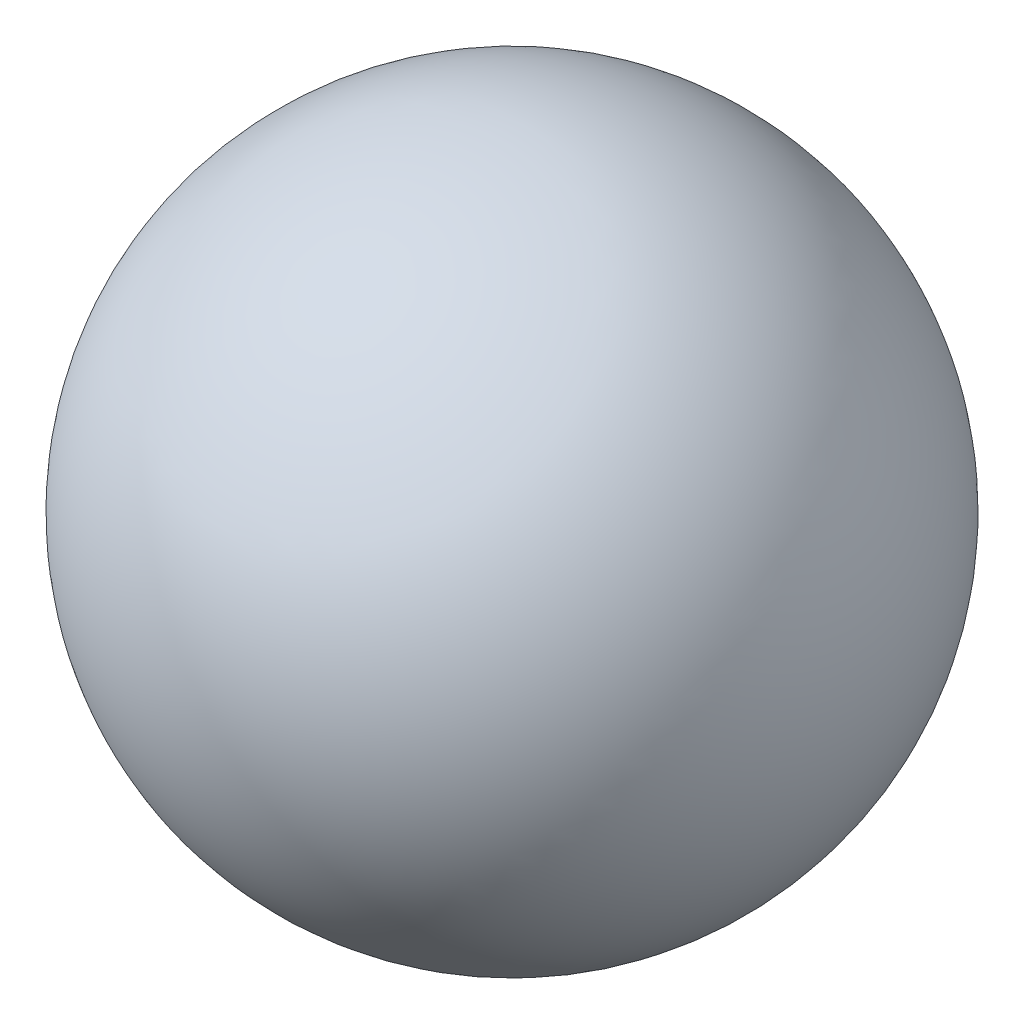
ISO-10303-21;
HEADER;
FILE_DESCRIPTION(('STEP AP214'),'2;1');
FILE_NAME('part.step','',(''),(''),'','','');
FILE_SCHEMA(('AUTOMOTIVE_DESIGN { 1 0 10303 214 1 1 1 1 }'));
ENDSEC;
DATA;
#1=APPLICATION_CONTEXT('core data for automotive mechanical design processes');
#2=APPLICATION_PROTOCOL_DEFINITION('international standard','automotive_design',2000,#1);
#3=PRODUCT_CONTEXT('',#1,'mechanical');
#4=PRODUCT('Part','Part','',(#3));
#5=PRODUCT_RELATED_PRODUCT_CATEGORY('part','',(#4));
#6=PRODUCT_DEFINITION_FORMATION('','',#4);
#7=PRODUCT_DEFINITION_CONTEXT('part definition',#1,'design');
#8=PRODUCT_DEFINITION('design','',#6,#7);
#9=PRODUCT_DEFINITION_SHAPE('','',#8);
#10=(LENGTH_UNIT() NAMED_UNIT(*) SI_UNIT(.MILLI.,.METRE.));
#11=(NAMED_UNIT(*) PLANE_ANGLE_UNIT() SI_UNIT($,.RADIAN.));
#12=(NAMED_UNIT(*) SI_UNIT($,.STERADIAN.) SOLID_ANGLE_UNIT());
#13=UNCERTAINTY_MEASURE_WITH_UNIT(LENGTH_MEASURE(1.E-05),#10,'distance_accuracy_value','');
#14=(GEOMETRIC_REPRESENTATION_CONTEXT(3) GLOBAL_UNCERTAINTY_ASSIGNED_CONTEXT((#13)) GLOBAL_UNIT_ASSIGNED_CONTEXT((#10,
#11,#12)) REPRESENTATION_CONTEXT('',''));
#15=CARTESIAN_POINT('',(0.,0.,0.));
#16=DIRECTION('',(0.,0.,1.));
#17=DIRECTION('',(1.,0.,0.));
#18=AXIS2_PLACEMENT_3D('',#15,#16,#17);
#19=CARTESIAN_POINT('',(-1.11690850882414,-2.,-11.6967950902337));
#20=DIRECTION('',(0.,0.,1.));
#21=DIRECTION('',(1.,0.,0.));
#22=AXIS2_PLACEMENT_3D('',#19,#20,#21);
#23=SPHERICAL_SURFACE('',#22,1.05);
#24=CARTESIAN_POINT('',(-1.11690850882414,-2.,-10.6467950902337));
#25=VERTEX_POINT('',#24);
#26=VERTEX_LOOP('',#25);
#27=FACE_BOUND('',#26,.T.);
#28=ADVANCED_FACE('F13',(#27),#23,.T.);
#29=CLOSED_SHELL('',(#28));
#30=MANIFOLD_SOLID_BREP('B1',#29);
#31=ADVANCED_BREP_SHAPE_REPRESENTATION('',(#18,#30),#14);
#32=SHAPE_DEFINITION_REPRESENTATION(#9,#31);
ENDSEC;
END-ISO-10303-21;
